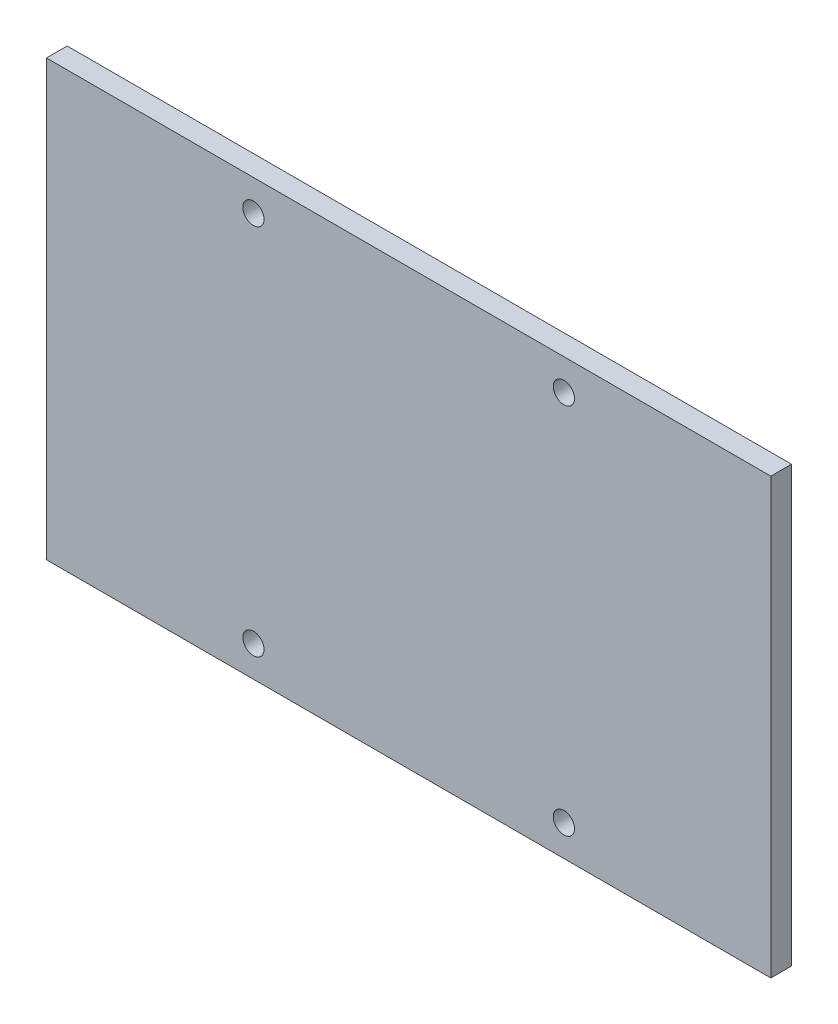
ISO-10303-21;
HEADER;
FILE_DESCRIPTION(('STEP AP214'),'2;1');
FILE_NAME('part.step','',(''),(''),'','','');
FILE_SCHEMA(('AUTOMOTIVE_DESIGN { 1 0 10303 214 1 1 1 1 }'));
ENDSEC;
DATA;
#1=APPLICATION_CONTEXT('core data for automotive mechanical design processes');
#2=APPLICATION_PROTOCOL_DEFINITION('international standard','automotive_design',2000,#1);
#3=PRODUCT_CONTEXT('',#1,'mechanical');
#4=PRODUCT('Part','Part','',(#3));
#5=PRODUCT_RELATED_PRODUCT_CATEGORY('part','',(#4));
#6=PRODUCT_DEFINITION_FORMATION('','',#4);
#7=PRODUCT_DEFINITION_CONTEXT('part definition',#1,'design');
#8=PRODUCT_DEFINITION('design','',#6,#7);
#9=PRODUCT_DEFINITION_SHAPE('','',#8);
#10=(LENGTH_UNIT() NAMED_UNIT(*) SI_UNIT(.MILLI.,.METRE.));
#11=(NAMED_UNIT(*) PLANE_ANGLE_UNIT() SI_UNIT($,.RADIAN.));
#12=(NAMED_UNIT(*) SI_UNIT($,.STERADIAN.) SOLID_ANGLE_UNIT());
#13=UNCERTAINTY_MEASURE_WITH_UNIT(LENGTH_MEASURE(1.E-05),#10,'distance_accuracy_value','');
#14=(GEOMETRIC_REPRESENTATION_CONTEXT(3) GLOBAL_UNCERTAINTY_ASSIGNED_CONTEXT((#13)) GLOBAL_UNIT_ASSIGNED_CONTEXT((#10,
#11,#12)) REPRESENTATION_CONTEXT('',''));
#15=CARTESIAN_POINT('',(0.,0.,0.));
#16=DIRECTION('',(0.,0.,1.));
#17=DIRECTION('',(1.,0.,0.));
#18=AXIS2_PLACEMENT_3D('',#15,#16,#17);
#19=CARTESIAN_POINT('',(0.,0.,2.));
#20=DIRECTION('',(0.,0.,1.));
#21=DIRECTION('',(1.,0.,0.));
#22=AXIS2_PLACEMENT_3D('',#19,#20,#21);
#23=PLANE('',#22);
#24=CARTESIAN_POINT('',(15.,-18.,2.));
#25=DIRECTION('',(0.,0.,1.));
#26=DIRECTION('',(1.,0.,0.));
#27=AXIS2_PLACEMENT_3D('',#24,#25,#26);
#28=CIRCLE('',#27,1.025);
#29=CARTESIAN_POINT('',(16.025,-18.,2.));
#30=VERTEX_POINT('',#29);
#31=EDGE_CURVE('E123',#30,#30,#28,.T.);
#32=ORIENTED_EDGE('',*,*,#31,.F.);
#33=EDGE_LOOP('',(#32));
#34=FACE_BOUND('',#33,.T.);
#35=CARTESIAN_POINT('',(-15.,18.,2.));
#36=DIRECTION('',(0.,0.,1.));
#37=DIRECTION('',(1.,0.,0.));
#38=AXIS2_PLACEMENT_3D('',#35,#36,#37);
#39=CIRCLE('',#38,1.025);
#40=CARTESIAN_POINT('',(-13.975,18.,2.));
#41=VERTEX_POINT('',#40);
#42=EDGE_CURVE('E102',#41,#41,#39,.T.);
#43=ORIENTED_EDGE('',*,*,#42,.F.);
#44=EDGE_LOOP('',(#43));
#45=FACE_BOUND('',#44,.T.);
#46=DIRECTION('',(0.,-1.,0.));
#47=VECTOR('',#46,1.);
#48=CARTESIAN_POINT('',(-35.,-21.,2.));
#49=LINE('',#48,#47);
#50=CARTESIAN_POINT('',(-35.,21.,2.));
#51=VERTEX_POINT('',#50);
#52=CARTESIAN_POINT('',(-35.,-21.,2.));
#53=VERTEX_POINT('',#52);
#54=EDGE_CURVE('E87',#51,#53,#49,.T.);
#55=ORIENTED_EDGE('',*,*,#54,.T.);
#56=DIRECTION('',(1.,0.,0.));
#57=VECTOR('',#56,1.);
#58=CARTESIAN_POINT('',(35.,-21.,2.));
#59=LINE('',#58,#57);
#60=CARTESIAN_POINT('',(35.,-21.,2.));
#61=VERTEX_POINT('',#60);
#62=EDGE_CURVE('E82',#53,#61,#59,.T.);
#63=ORIENTED_EDGE('',*,*,#62,.T.);
#64=DIRECTION('',(0.,1.,0.));
#65=VECTOR('',#64,1.);
#66=CARTESIAN_POINT('',(35.,-21.,2.));
#67=LINE('',#66,#65);
#68=CARTESIAN_POINT('',(35.,21.,2.));
#69=VERTEX_POINT('',#68);
#70=EDGE_CURVE('E85',#61,#69,#67,.T.);
#71=ORIENTED_EDGE('',*,*,#70,.T.);
#72=DIRECTION('',(-1.,0.,0.));
#73=VECTOR('',#72,1.);
#74=CARTESIAN_POINT('',(35.,21.,2.));
#75=LINE('',#74,#73);
#76=EDGE_CURVE('E52',#69,#51,#75,.T.);
#77=ORIENTED_EDGE('',*,*,#76,.T.);
#78=EDGE_LOOP('',(#55,#63,#71,#77));
#79=FACE_BOUND('',#78,.T.);
#80=CARTESIAN_POINT('',(15.,18.,2.));
#81=DIRECTION('',(0.,0.,1.));
#82=DIRECTION('',(1.,0.,0.));
#83=AXIS2_PLACEMENT_3D('',#80,#81,#82);
#84=CIRCLE('',#83,1.025);
#85=CARTESIAN_POINT('',(16.025,18.,2.));
#86=VERTEX_POINT('',#85);
#87=EDGE_CURVE('E117',#86,#86,#84,.T.);
#88=ORIENTED_EDGE('',*,*,#87,.F.);
#89=EDGE_LOOP('',(#88));
#90=FACE_BOUND('',#89,.T.);
#91=CARTESIAN_POINT('',(-15.,-18.,2.));
#92=DIRECTION('',(0.,0.,1.));
#93=DIRECTION('',(1.,0.,0.));
#94=AXIS2_PLACEMENT_3D('',#91,#92,#93);
#95=CIRCLE('',#94,1.025);
#96=CARTESIAN_POINT('',(-13.975,-18.,2.));
#97=VERTEX_POINT('',#96);
#98=EDGE_CURVE('E129',#97,#97,#95,.T.);
#99=ORIENTED_EDGE('',*,*,#98,.F.);
#100=EDGE_LOOP('',(#99));
#101=FACE_BOUND('',#100,.T.);
#102=ADVANCED_FACE('F35',(#34,#45,#79,#90,#101),#23,.T.);
#103=CARTESIAN_POINT('',(0.,0.,0.));
#104=DIRECTION('',(0.,0.,1.));
#105=DIRECTION('',(1.,0.,0.));
#106=AXIS2_PLACEMENT_3D('',#103,#104,#105);
#107=PLANE('',#106);
#108=DIRECTION('',(0.,-1.,0.));
#109=VECTOR('',#108,1.);
#110=CARTESIAN_POINT('',(-35.,-21.,0.));
#111=LINE('',#110,#109);
#112=CARTESIAN_POINT('',(-35.,21.,0.));
#113=VERTEX_POINT('',#112);
#114=CARTESIAN_POINT('',(-35.,-21.,0.));
#115=VERTEX_POINT('',#114);
#116=EDGE_CURVE('E99',#113,#115,#111,.T.);
#117=ORIENTED_EDGE('',*,*,#116,.F.);
#118=DIRECTION('',(-1.,0.,0.));
#119=VECTOR('',#118,1.);
#120=CARTESIAN_POINT('',(35.,21.,0.));
#121=LINE('',#120,#119);
#122=CARTESIAN_POINT('',(35.,21.,0.));
#123=VERTEX_POINT('',#122);
#124=EDGE_CURVE('E75',#123,#113,#121,.T.);
#125=ORIENTED_EDGE('',*,*,#124,.F.);
#126=DIRECTION('',(0.,1.,0.));
#127=VECTOR('',#126,1.);
#128=CARTESIAN_POINT('',(35.,-21.,0.));
#129=LINE('',#128,#127);
#130=CARTESIAN_POINT('',(35.,-21.,0.));
#131=VERTEX_POINT('',#130);
#132=EDGE_CURVE('E69',#131,#123,#129,.T.);
#133=ORIENTED_EDGE('',*,*,#132,.F.);
#134=DIRECTION('',(1.,0.,0.));
#135=VECTOR('',#134,1.);
#136=CARTESIAN_POINT('',(35.,-21.,0.));
#137=LINE('',#136,#135);
#138=EDGE_CURVE('E91',#115,#131,#137,.T.);
#139=ORIENTED_EDGE('',*,*,#138,.F.);
#140=EDGE_LOOP('',(#117,#125,#133,#139));
#141=FACE_BOUND('',#140,.T.);
#142=CARTESIAN_POINT('',(-15.,18.,0.));
#143=DIRECTION('',(0.,0.,1.));
#144=DIRECTION('',(1.,0.,0.));
#145=AXIS2_PLACEMENT_3D('',#142,#143,#144);
#146=CIRCLE('',#145,1.025);
#147=CARTESIAN_POINT('',(-13.975,18.,0.));
#148=VERTEX_POINT('',#147);
#149=EDGE_CURVE('E114',#148,#148,#146,.T.);
#150=ORIENTED_EDGE('',*,*,#149,.T.);
#151=EDGE_LOOP('',(#150));
#152=FACE_BOUND('',#151,.T.);
#153=CARTESIAN_POINT('',(15.,18.,0.));
#154=DIRECTION('',(0.,0.,1.));
#155=DIRECTION('',(1.,0.,0.));
#156=AXIS2_PLACEMENT_3D('',#153,#154,#155);
#157=CIRCLE('',#156,1.025);
#158=CARTESIAN_POINT('',(16.025,18.,0.));
#159=VERTEX_POINT('',#158);
#160=EDGE_CURVE('E120',#159,#159,#157,.T.);
#161=ORIENTED_EDGE('',*,*,#160,.T.);
#162=EDGE_LOOP('',(#161));
#163=FACE_BOUND('',#162,.T.);
#164=CARTESIAN_POINT('',(15.,-18.,0.));
#165=DIRECTION('',(0.,0.,1.));
#166=DIRECTION('',(1.,0.,0.));
#167=AXIS2_PLACEMENT_3D('',#164,#165,#166);
#168=CIRCLE('',#167,1.025);
#169=CARTESIAN_POINT('',(16.025,-18.,0.));
#170=VERTEX_POINT('',#169);
#171=EDGE_CURVE('E126',#170,#170,#168,.T.);
#172=ORIENTED_EDGE('',*,*,#171,.T.);
#173=EDGE_LOOP('',(#172));
#174=FACE_BOUND('',#173,.T.);
#175=CARTESIAN_POINT('',(-15.,-18.,0.));
#176=DIRECTION('',(0.,0.,1.));
#177=DIRECTION('',(1.,0.,0.));
#178=AXIS2_PLACEMENT_3D('',#175,#176,#177);
#179=CIRCLE('',#178,1.025);
#180=CARTESIAN_POINT('',(-13.975,-18.,0.));
#181=VERTEX_POINT('',#180);
#182=EDGE_CURVE('E132',#181,#181,#179,.T.);
#183=ORIENTED_EDGE('',*,*,#182,.T.);
#184=EDGE_LOOP('',(#183));
#185=FACE_BOUND('',#184,.T.);
#186=ADVANCED_FACE('F110',(#141,#152,#163,#174,#185),#107,.F.);
#187=CARTESIAN_POINT('',(-35.,-21.,2.));
#188=DIRECTION('',(1.,0.,0.));
#189=DIRECTION('',(0.,0.,-1.));
#190=AXIS2_PLACEMENT_3D('',#187,#188,#189);
#191=PLANE('',#190);
#192=ORIENTED_EDGE('',*,*,#116,.T.);
#193=DIRECTION('',(0.,0.,-1.));
#194=VECTOR('',#193,1.);
#195=CARTESIAN_POINT('',(-35.,-21.,2.));
#196=LINE('',#195,#194);
#197=EDGE_CURVE('E11',#53,#115,#196,.T.);
#198=ORIENTED_EDGE('',*,*,#197,.F.);
#199=ORIENTED_EDGE('',*,*,#54,.F.);
#200=DIRECTION('',(0.,0.,-1.));
#201=VECTOR('',#200,1.);
#202=CARTESIAN_POINT('',(-35.,21.,2.));
#203=LINE('',#202,#201);
#204=EDGE_CURVE('E95',#51,#113,#203,.T.);
#205=ORIENTED_EDGE('',*,*,#204,.T.);
#206=EDGE_LOOP('',(#192,#198,#199,#205));
#207=FACE_BOUND('',#206,.T.);
#208=ADVANCED_FACE('F37',(#207),#191,.F.);
#209=CARTESIAN_POINT('',(35.,-21.,2.));
#210=DIRECTION('',(0.,1.,0.));
#211=DIRECTION('',(0.,0.,1.));
#212=AXIS2_PLACEMENT_3D('',#209,#210,#211);
#213=PLANE('',#212);
#214=ORIENTED_EDGE('',*,*,#138,.T.);
#215=DIRECTION('',(0.,0.,-1.));
#216=VECTOR('',#215,1.);
#217=CARTESIAN_POINT('',(35.,-21.,2.));
#218=LINE('',#217,#216);
#219=EDGE_CURVE('E44',#61,#131,#218,.T.);
#220=ORIENTED_EDGE('',*,*,#219,.F.);
#221=ORIENTED_EDGE('',*,*,#62,.F.);
#222=ORIENTED_EDGE('',*,*,#197,.T.);
#223=EDGE_LOOP('',(#214,#220,#221,#222));
#224=FACE_BOUND('',#223,.T.);
#225=ADVANCED_FACE('F90',(#224),#213,.F.);
#226=CARTESIAN_POINT('',(35.,-21.,2.));
#227=DIRECTION('',(-1.,0.,0.));
#228=DIRECTION('',(0.,0.,1.));
#229=AXIS2_PLACEMENT_3D('',#226,#227,#228);
#230=PLANE('',#229);
#231=ORIENTED_EDGE('',*,*,#132,.T.);
#232=DIRECTION('',(0.,0.,-1.));
#233=VECTOR('',#232,1.);
#234=CARTESIAN_POINT('',(35.,21.,2.));
#235=LINE('',#234,#233);
#236=EDGE_CURVE('E92',#69,#123,#235,.T.);
#237=ORIENTED_EDGE('',*,*,#236,.F.);
#238=ORIENTED_EDGE('',*,*,#70,.F.);
#239=ORIENTED_EDGE('',*,*,#219,.T.);
#240=EDGE_LOOP('',(#231,#237,#238,#239));
#241=FACE_BOUND('',#240,.T.);
#242=ADVANCED_FACE('F93',(#241),#230,.F.);
#243=CARTESIAN_POINT('',(35.,21.,2.));
#244=DIRECTION('',(0.,-1.,0.));
#245=DIRECTION('',(0.,0.,-1.));
#246=AXIS2_PLACEMENT_3D('',#243,#244,#245);
#247=PLANE('',#246);
#248=ORIENTED_EDGE('',*,*,#124,.T.);
#249=ORIENTED_EDGE('',*,*,#204,.F.);
#250=ORIENTED_EDGE('',*,*,#76,.F.);
#251=ORIENTED_EDGE('',*,*,#236,.T.);
#252=EDGE_LOOP('',(#248,#249,#250,#251));
#253=FACE_BOUND('',#252,.T.);
#254=ADVANCED_FACE('F107',(#253),#247,.F.);
#255=CARTESIAN_POINT('',(-15.,18.,2.));
#256=DIRECTION('',(0.,0.,-1.));
#257=DIRECTION('',(-1.,0.,0.));
#258=AXIS2_PLACEMENT_3D('',#255,#256,#257);
#259=CYLINDRICAL_SURFACE('',#258,1.025);
#260=ORIENTED_EDGE('',*,*,#42,.T.);
#261=EDGE_LOOP('',(#260));
#262=FACE_BOUND('',#261,.T.);
#263=ORIENTED_EDGE('',*,*,#149,.F.);
#264=EDGE_LOOP('',(#263));
#265=FACE_BOUND('',#264,.T.);
#266=ADVANCED_FACE('F151',(#262,#265),#259,.F.);
#267=CARTESIAN_POINT('',(15.,18.,2.));
#268=DIRECTION('',(0.,0.,-1.));
#269=DIRECTION('',(-1.,0.,0.));
#270=AXIS2_PLACEMENT_3D('',#267,#268,#269);
#271=CYLINDRICAL_SURFACE('',#270,1.025);
#272=ORIENTED_EDGE('',*,*,#87,.T.);
#273=EDGE_LOOP('',(#272));
#274=FACE_BOUND('',#273,.T.);
#275=ORIENTED_EDGE('',*,*,#160,.F.);
#276=EDGE_LOOP('',(#275));
#277=FACE_BOUND('',#276,.T.);
#278=ADVANCED_FACE('F197',(#274,#277),#271,.F.);
#279=CARTESIAN_POINT('',(15.,-18.,2.));
#280=DIRECTION('',(0.,0.,-1.));
#281=DIRECTION('',(-1.,0.,0.));
#282=AXIS2_PLACEMENT_3D('',#279,#280,#281);
#283=CYLINDRICAL_SURFACE('',#282,1.025);
#284=ORIENTED_EDGE('',*,*,#31,.T.);
#285=EDGE_LOOP('',(#284));
#286=FACE_BOUND('',#285,.T.);
#287=ORIENTED_EDGE('',*,*,#171,.F.);
#288=EDGE_LOOP('',(#287));
#289=FACE_BOUND('',#288,.T.);
#290=ADVANCED_FACE('F205',(#286,#289),#283,.F.);
#291=CARTESIAN_POINT('',(-15.,-18.,2.));
#292=DIRECTION('',(0.,0.,-1.));
#293=DIRECTION('',(-1.,0.,0.));
#294=AXIS2_PLACEMENT_3D('',#291,#292,#293);
#295=CYLINDRICAL_SURFACE('',#294,1.025);
#296=ORIENTED_EDGE('',*,*,#98,.T.);
#297=EDGE_LOOP('',(#296));
#298=FACE_BOUND('',#297,.T.);
#299=ORIENTED_EDGE('',*,*,#182,.F.);
#300=EDGE_LOOP('',(#299));
#301=FACE_BOUND('',#300,.T.);
#302=ADVANCED_FACE('F138',(#298,#301),#295,.F.);
#303=CLOSED_SHELL('',(#102,#186,#208,#225,#242,#254,#266,#278,#290,#302));
#304=MANIFOLD_SOLID_BREP('B2',#303);
#305=ADVANCED_BREP_SHAPE_REPRESENTATION('',(#18,#304),#14);
#306=SHAPE_DEFINITION_REPRESENTATION(#9,#305);
ENDSEC;
END-ISO-10303-21;
